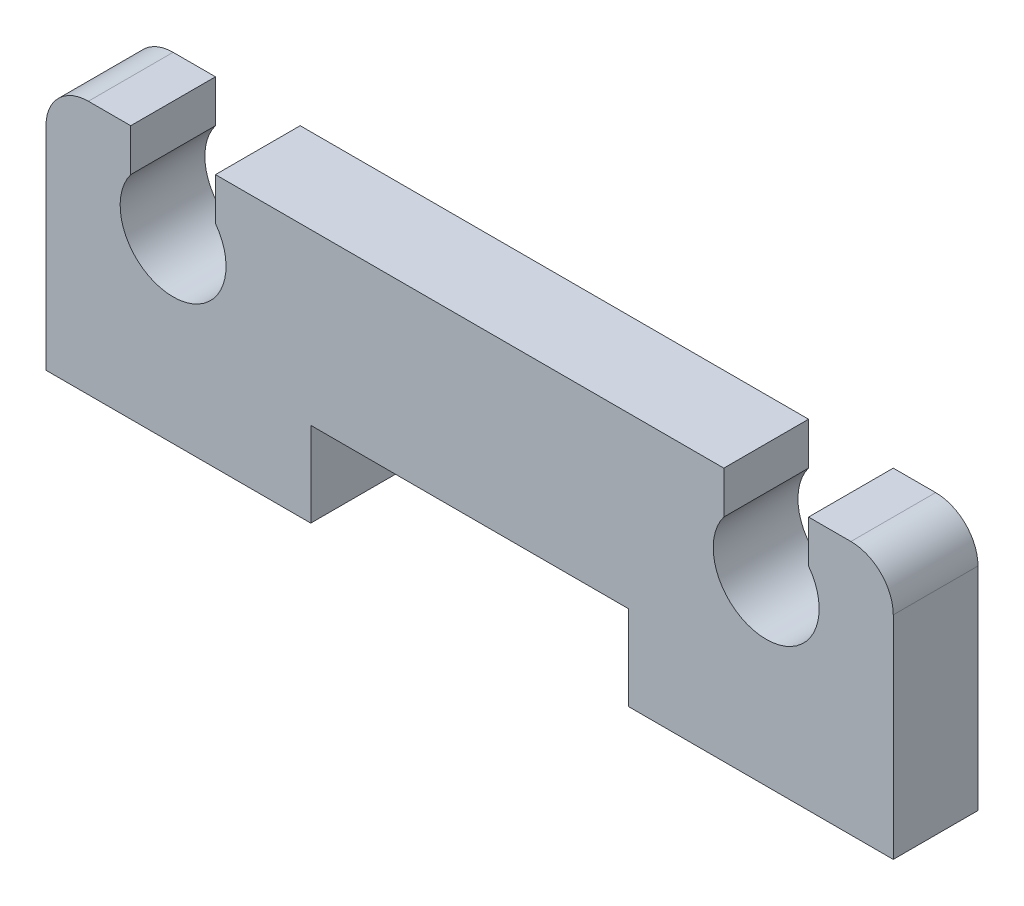
ISO-10303-21;
HEADER;
FILE_DESCRIPTION(('STEP AP214'),'2;1');
FILE_NAME('part.step','',(''),(''),'','','');
FILE_SCHEMA(('AUTOMOTIVE_DESIGN { 1 0 10303 214 1 1 1 1 }'));
ENDSEC;
DATA;
#1=APPLICATION_CONTEXT('core data for automotive mechanical design processes');
#2=APPLICATION_PROTOCOL_DEFINITION('international standard','automotive_design',2000,#1);
#3=PRODUCT_CONTEXT('',#1,'mechanical');
#4=PRODUCT('Part','Part','',(#3));
#5=PRODUCT_RELATED_PRODUCT_CATEGORY('part','',(#4));
#6=PRODUCT_DEFINITION_FORMATION('','',#4);
#7=PRODUCT_DEFINITION_CONTEXT('part definition',#1,'design');
#8=PRODUCT_DEFINITION('design','',#6,#7);
#9=PRODUCT_DEFINITION_SHAPE('','',#8);
#10=(LENGTH_UNIT() NAMED_UNIT(*) SI_UNIT(.MILLI.,.METRE.));
#11=(NAMED_UNIT(*) PLANE_ANGLE_UNIT() SI_UNIT($,.RADIAN.));
#12=(NAMED_UNIT(*) SI_UNIT($,.STERADIAN.) SOLID_ANGLE_UNIT());
#13=UNCERTAINTY_MEASURE_WITH_UNIT(LENGTH_MEASURE(1.E-05),#10,'distance_accuracy_value','');
#14=(GEOMETRIC_REPRESENTATION_CONTEXT(3) GLOBAL_UNCERTAINTY_ASSIGNED_CONTEXT((#13)) GLOBAL_UNIT_ASSIGNED_CONTEXT((#10,
#11,#12)) REPRESENTATION_CONTEXT('',''));
#15=CARTESIAN_POINT('',(0.,0.,0.));
#16=DIRECTION('',(0.,0.,1.));
#17=DIRECTION('',(1.,0.,0.));
#18=AXIS2_PLACEMENT_3D('',#15,#16,#17);
#19=CARTESIAN_POINT('',(0.99999999999989,4.99999999999962,2.));
#20=DIRECTION('',(0.,0.,-1.));
#21=DIRECTION('',(-1.,0.,0.));
#22=AXIS2_PLACEMENT_3D('',#19,#20,#21);
#23=CYLINDRICAL_SURFACE('',#22,0.999999999999896);
#24=CARTESIAN_POINT('',(0.99999999999989,4.99999999999962,0.));
#25=DIRECTION('',(0.,0.,1.));
#26=DIRECTION('',(1.,0.,0.));
#27=AXIS2_PLACEMENT_3D('',#24,#25,#26);
#28=CIRCLE('',#27,0.999999999999896);
#29=CARTESIAN_POINT('',(0.99999999999989,5.99999999999953,0.));
#30=VERTEX_POINT('',#29);
#31=CARTESIAN_POINT('',(0.,4.99999999999963,0.));
#32=VERTEX_POINT('',#31);
#33=EDGE_CURVE('E189',#30,#32,#28,.T.);
#34=ORIENTED_EDGE('',*,*,#33,.T.);
#35=DIRECTION('',(0.,0.,-1.));
#36=VECTOR('',#35,1.);
#37=CARTESIAN_POINT('',(0.,4.99999999999963,2.));
#38=LINE('',#37,#36);
#39=CARTESIAN_POINT('',(0.,4.99999999999963,2.));
#40=VERTEX_POINT('',#39);
#41=EDGE_CURVE('E11',#40,#32,#38,.T.);
#42=ORIENTED_EDGE('',*,*,#41,.F.);
#43=CARTESIAN_POINT('',(0.99999999999989,4.99999999999962,2.));
#44=DIRECTION('',(0.,0.,1.));
#45=DIRECTION('',(1.,0.,0.));
#46=AXIS2_PLACEMENT_3D('',#43,#44,#45);
#47=CIRCLE('',#46,0.999999999999896);
#48=CARTESIAN_POINT('',(0.99999999999989,5.99999999999953,2.));
#49=VERTEX_POINT('',#48);
#50=EDGE_CURVE('E223',#49,#40,#47,.T.);
#51=ORIENTED_EDGE('',*,*,#50,.F.);
#52=DIRECTION('',(0.,0.,-1.));
#53=VECTOR('',#52,1.);
#54=CARTESIAN_POINT('',(0.99999999999989,5.99999999999953,2.));
#55=LINE('',#54,#53);
#56=EDGE_CURVE('E185',#49,#30,#55,.T.);
#57=ORIENTED_EDGE('',*,*,#56,.T.);
#58=EDGE_LOOP('',(#34,#42,#51,#57));
#59=FACE_BOUND('',#58,.T.);
#60=ADVANCED_FACE('F33',(#59),#23,.T.);
#61=CARTESIAN_POINT('',(0.,0.,2.));
#62=DIRECTION('',(1.,0.,0.));
#63=DIRECTION('',(0.,0.,-1.));
#64=AXIS2_PLACEMENT_3D('',#61,#62,#63);
#65=PLANE('',#64);
#66=DIRECTION('',(0.,-1.,0.));
#67=VECTOR('',#66,1.);
#68=CARTESIAN_POINT('',(0.,0.,0.));
#69=LINE('',#68,#67);
#70=CARTESIAN_POINT('',(0.,0.,0.));
#71=VERTEX_POINT('',#70);
#72=EDGE_CURVE('E192',#32,#71,#69,.T.);
#73=ORIENTED_EDGE('',*,*,#72,.T.);
#74=DIRECTION('',(0.,0.,-1.));
#75=VECTOR('',#74,1.);
#76=CARTESIAN_POINT('',(0.,0.,2.));
#77=LINE('',#76,#75);
#78=CARTESIAN_POINT('',(0.,0.,2.));
#79=VERTEX_POINT('',#78);
#80=EDGE_CURVE('E41',#79,#71,#77,.T.);
#81=ORIENTED_EDGE('',*,*,#80,.F.);
#82=DIRECTION('',(0.,-1.,0.));
#83=VECTOR('',#82,1.);
#84=CARTESIAN_POINT('',(0.,0.,2.));
#85=LINE('',#84,#83);
#86=EDGE_CURVE('E122',#40,#79,#85,.T.);
#87=ORIENTED_EDGE('',*,*,#86,.F.);
#88=ORIENTED_EDGE('',*,*,#41,.T.);
#89=EDGE_LOOP('',(#73,#81,#87,#88));
#90=FACE_BOUND('',#89,.T.);
#91=ADVANCED_FACE('F331',(#90),#65,.F.);
#92=CARTESIAN_POINT('',(0.,0.,2.));
#93=DIRECTION('',(0.,1.,0.));
#94=DIRECTION('',(0.,0.,1.));
#95=AXIS2_PLACEMENT_3D('',#92,#93,#94);
#96=PLANE('',#95);
#97=DIRECTION('',(1.,0.,0.));
#98=VECTOR('',#97,1.);
#99=CARTESIAN_POINT('',(0.,0.,0.));
#100=LINE('',#99,#98);
#101=CARTESIAN_POINT('',(6.25000000000026,0.,0.));
#102=VERTEX_POINT('',#101);
#103=EDGE_CURVE('E194',#71,#102,#100,.T.);
#104=ORIENTED_EDGE('',*,*,#103,.T.);
#105=DIRECTION('',(0.,0.,-1.));
#106=VECTOR('',#105,1.);
#107=CARTESIAN_POINT('',(6.25000000000026,0.,2.));
#108=LINE('',#107,#106);
#109=CARTESIAN_POINT('',(6.25000000000026,0.,2.));
#110=VERTEX_POINT('',#109);
#111=EDGE_CURVE('E260',#110,#102,#108,.T.);
#112=ORIENTED_EDGE('',*,*,#111,.F.);
#113=DIRECTION('',(1.,0.,0.));
#114=VECTOR('',#113,1.);
#115=CARTESIAN_POINT('',(0.,0.,2.));
#116=LINE('',#115,#114);
#117=EDGE_CURVE('E268',#79,#110,#116,.T.);
#118=ORIENTED_EDGE('',*,*,#117,.F.);
#119=ORIENTED_EDGE('',*,*,#80,.T.);
#120=EDGE_LOOP('',(#104,#112,#118,#119));
#121=FACE_BOUND('',#120,.T.);
#122=ADVANCED_FACE('F266',(#121),#96,.F.);
#123=CARTESIAN_POINT('',(6.25000000000026,2.00000000000022,2.));
#124=DIRECTION('',(-1.,0.,0.));
#125=DIRECTION('',(0.,0.,1.));
#126=AXIS2_PLACEMENT_3D('',#123,#124,#125);
#127=PLANE('',#126);
#128=DIRECTION('',(0.,1.,0.));
#129=VECTOR('',#128,1.);
#130=CARTESIAN_POINT('',(6.25000000000026,2.00000000000022,0.));
#131=LINE('',#130,#129);
#132=CARTESIAN_POINT('',(6.25000000000026,2.00000000000022,0.));
#133=VERTEX_POINT('',#132);
#134=EDGE_CURVE('E196',#102,#133,#131,.T.);
#135=ORIENTED_EDGE('',*,*,#134,.T.);
#136=DIRECTION('',(0.,0.,-1.));
#137=VECTOR('',#136,1.);
#138=CARTESIAN_POINT('',(6.25000000000026,2.00000000000022,2.));
#139=LINE('',#138,#137);
#140=CARTESIAN_POINT('',(6.25000000000026,2.00000000000022,2.));
#141=VERTEX_POINT('',#140);
#142=EDGE_CURVE('E257',#141,#133,#139,.T.);
#143=ORIENTED_EDGE('',*,*,#142,.F.);
#144=DIRECTION('',(0.,1.,0.));
#145=VECTOR('',#144,1.);
#146=CARTESIAN_POINT('',(6.25000000000026,2.00000000000022,2.));
#147=LINE('',#146,#145);
#148=EDGE_CURVE('E286',#110,#141,#147,.T.);
#149=ORIENTED_EDGE('',*,*,#148,.F.);
#150=ORIENTED_EDGE('',*,*,#111,.T.);
#151=EDGE_LOOP('',(#135,#143,#149,#150));
#152=FACE_BOUND('',#151,.T.);
#153=ADVANCED_FACE('F277',(#152),#127,.F.);
#154=CARTESIAN_POINT('',(6.25000000000026,2.00000000000022,2.));
#155=DIRECTION('',(0.,1.,0.));
#156=DIRECTION('',(0.,0.,1.));
#157=AXIS2_PLACEMENT_3D('',#154,#155,#156);
#158=PLANE('',#157);
#159=DIRECTION('',(1.,0.,0.));
#160=VECTOR('',#159,1.);
#161=CARTESIAN_POINT('',(6.25000000000026,2.00000000000022,0.));
#162=LINE('',#161,#160);
#163=CARTESIAN_POINT('',(13.7500000000023,2.00000000000022,0.));
#164=VERTEX_POINT('',#163);
#165=EDGE_CURVE('E198',#133,#164,#162,.T.);
#166=ORIENTED_EDGE('',*,*,#165,.T.);
#167=DIRECTION('',(0.,0.,-1.));
#168=VECTOR('',#167,1.);
#169=CARTESIAN_POINT('',(13.7500000000023,2.00000000000022,2.));
#170=LINE('',#169,#168);
#171=CARTESIAN_POINT('',(13.7500000000023,2.00000000000022,2.));
#172=VERTEX_POINT('',#171);
#173=EDGE_CURVE('E254',#172,#164,#170,.T.);
#174=ORIENTED_EDGE('',*,*,#173,.F.);
#175=DIRECTION('',(1.,0.,0.));
#176=VECTOR('',#175,1.);
#177=CARTESIAN_POINT('',(6.25000000000026,2.00000000000022,2.));
#178=LINE('',#177,#176);
#179=EDGE_CURVE('E283',#141,#172,#178,.T.);
#180=ORIENTED_EDGE('',*,*,#179,.F.);
#181=ORIENTED_EDGE('',*,*,#142,.T.);
#182=EDGE_LOOP('',(#166,#174,#180,#181));
#183=FACE_BOUND('',#182,.T.);
#184=ADVANCED_FACE('F281',(#183),#158,.F.);
#185=CARTESIAN_POINT('',(13.7500000000023,2.00000000000022,2.));
#186=DIRECTION('',(1.,0.,0.));
#187=DIRECTION('',(0.,0.,-1.));
#188=AXIS2_PLACEMENT_3D('',#185,#186,#187);
#189=PLANE('',#188);
#190=DIRECTION('',(0.,-1.,0.));
#191=VECTOR('',#190,1.);
#192=CARTESIAN_POINT('',(13.7500000000023,2.00000000000022,0.));
#193=LINE('',#192,#191);
#194=CARTESIAN_POINT('',(13.7500000000023,0.,0.));
#195=VERTEX_POINT('',#194);
#196=EDGE_CURVE('E200',#164,#195,#193,.T.);
#197=ORIENTED_EDGE('',*,*,#196,.T.);
#198=DIRECTION('',(0.,0.,-1.));
#199=VECTOR('',#198,1.);
#200=CARTESIAN_POINT('',(13.7500000000023,0.,2.));
#201=LINE('',#200,#199);
#202=CARTESIAN_POINT('',(13.7500000000023,0.,2.));
#203=VERTEX_POINT('',#202);
#204=EDGE_CURVE('E251',#203,#195,#201,.T.);
#205=ORIENTED_EDGE('',*,*,#204,.F.);
#206=DIRECTION('',(0.,-1.,0.));
#207=VECTOR('',#206,1.);
#208=CARTESIAN_POINT('',(13.7500000000023,2.00000000000022,2.));
#209=LINE('',#208,#207);
#210=EDGE_CURVE('E285',#172,#203,#209,.T.);
#211=ORIENTED_EDGE('',*,*,#210,.F.);
#212=ORIENTED_EDGE('',*,*,#173,.T.);
#213=EDGE_LOOP('',(#197,#205,#211,#212));
#214=FACE_BOUND('',#213,.T.);
#215=ADVANCED_FACE('F344',(#214),#189,.F.);
#216=CARTESIAN_POINT('',(13.7500000000023,0.,2.));
#217=DIRECTION('',(0.,1.,0.));
#218=DIRECTION('',(-1.,0.,0.));
#219=AXIS2_PLACEMENT_3D('',#216,#217,#218);
#220=PLANE('',#219);
#221=DIRECTION('',(1.,0.,0.));
#222=VECTOR('',#221,1.);
#223=CARTESIAN_POINT('',(13.7500000000023,0.,0.));
#224=LINE('',#223,#222);
#225=CARTESIAN_POINT('',(20.0000000000026,0.,0.));
#226=VERTEX_POINT('',#225);
#227=EDGE_CURVE('E202',#195,#226,#224,.T.);
#228=ORIENTED_EDGE('',*,*,#227,.T.);
#229=DIRECTION('',(0.,0.,-1.));
#230=VECTOR('',#229,1.);
#231=CARTESIAN_POINT('',(20.0000000000026,0.,2.));
#232=LINE('',#231,#230);
#233=CARTESIAN_POINT('',(20.0000000000026,0.,2.));
#234=VERTEX_POINT('',#233);
#235=EDGE_CURVE('E248',#234,#226,#232,.T.);
#236=ORIENTED_EDGE('',*,*,#235,.F.);
#237=DIRECTION('',(1.,0.,0.));
#238=VECTOR('',#237,1.);
#239=CARTESIAN_POINT('',(13.7500000000023,0.,2.));
#240=LINE('',#239,#238);
#241=EDGE_CURVE('E288',#203,#234,#240,.T.);
#242=ORIENTED_EDGE('',*,*,#241,.F.);
#243=ORIENTED_EDGE('',*,*,#204,.T.);
#244=EDGE_LOOP('',(#228,#236,#242,#243));
#245=FACE_BOUND('',#244,.T.);
#246=ADVANCED_FACE('F347',(#245),#220,.F.);
#247=CARTESIAN_POINT('',(20.0000000000026,4.99999999999986,2.));
#248=DIRECTION('',(-1.,0.,0.));
#249=DIRECTION('',(0.,0.,1.));
#250=AXIS2_PLACEMENT_3D('',#247,#248,#249);
#251=PLANE('',#250);
#252=DIRECTION('',(0.,1.,0.));
#253=VECTOR('',#252,1.);
#254=CARTESIAN_POINT('',(20.0000000000026,4.99999999999986,0.));
#255=LINE('',#254,#253);
#256=CARTESIAN_POINT('',(20.0000000000026,4.99999999999986,0.));
#257=VERTEX_POINT('',#256);
#258=EDGE_CURVE('E204',#226,#257,#255,.T.);
#259=ORIENTED_EDGE('',*,*,#258,.T.);
#260=DIRECTION('',(0.,0.,-1.));
#261=VECTOR('',#260,1.);
#262=CARTESIAN_POINT('',(20.0000000000026,4.99999999999986,2.));
#263=LINE('',#262,#261);
#264=CARTESIAN_POINT('',(20.0000000000026,4.99999999999986,2.));
#265=VERTEX_POINT('',#264);
#266=EDGE_CURVE('E245',#265,#257,#263,.T.);
#267=ORIENTED_EDGE('',*,*,#266,.F.);
#268=DIRECTION('',(0.,1.,0.));
#269=VECTOR('',#268,1.);
#270=CARTESIAN_POINT('',(20.0000000000026,4.99999999999986,2.));
#271=LINE('',#270,#269);
#272=EDGE_CURVE('E294',#234,#265,#271,.T.);
#273=ORIENTED_EDGE('',*,*,#272,.F.);
#274=ORIENTED_EDGE('',*,*,#235,.T.);
#275=EDGE_LOOP('',(#259,#267,#273,#274));
#276=FACE_BOUND('',#275,.T.);
#277=ADVANCED_FACE('F351',(#276),#251,.F.);
#278=CARTESIAN_POINT('',(19.0000000000027,4.99999999999986,2.));
#279=DIRECTION('',(0.,0.,-1.));
#280=DIRECTION('',(-1.,0.,0.));
#281=AXIS2_PLACEMENT_3D('',#278,#279,#280);
#282=CYLINDRICAL_SURFACE('',#281,0.99999999999989);
#283=CARTESIAN_POINT('',(19.0000000000027,4.99999999999986,0.));
#284=DIRECTION('',(0.,0.,1.));
#285=DIRECTION('',(1.,0.,0.));
#286=AXIS2_PLACEMENT_3D('',#283,#284,#285);
#287=CIRCLE('',#286,0.99999999999989);
#288=CARTESIAN_POINT('',(19.0000000000027,5.99999999999975,0.));
#289=VERTEX_POINT('',#288);
#290=EDGE_CURVE('E206',#257,#289,#287,.T.);
#291=ORIENTED_EDGE('',*,*,#290,.T.);
#292=DIRECTION('',(0.,0.,-1.));
#293=VECTOR('',#292,1.);
#294=CARTESIAN_POINT('',(19.0000000000027,5.99999999999975,2.));
#295=LINE('',#294,#293);
#296=CARTESIAN_POINT('',(19.0000000000027,5.99999999999975,2.));
#297=VERTEX_POINT('',#296);
#298=EDGE_CURVE('E242',#297,#289,#295,.T.);
#299=ORIENTED_EDGE('',*,*,#298,.F.);
#300=CARTESIAN_POINT('',(19.0000000000027,4.99999999999986,2.));
#301=DIRECTION('',(0.,0.,1.));
#302=DIRECTION('',(1.,0.,0.));
#303=AXIS2_PLACEMENT_3D('',#300,#301,#302);
#304=CIRCLE('',#303,0.99999999999989);
#305=EDGE_CURVE('E296',#265,#297,#304,.T.);
#306=ORIENTED_EDGE('',*,*,#305,.F.);
#307=ORIENTED_EDGE('',*,*,#266,.T.);
#308=EDGE_LOOP('',(#291,#299,#306,#307));
#309=FACE_BOUND('',#308,.T.);
#310=ADVANCED_FACE('F355',(#309),#282,.T.);
#311=CARTESIAN_POINT('',(18.0000000000028,5.99999999999975,2.));
#312=DIRECTION('',(0.,-1.,0.));
#313=DIRECTION('',(0.,0.,-1.));
#314=AXIS2_PLACEMENT_3D('',#311,#312,#313);
#315=PLANE('',#314);
#316=DIRECTION('',(-1.,0.,0.));
#317=VECTOR('',#316,1.);
#318=CARTESIAN_POINT('',(18.0000000000028,5.99999999999975,0.));
#319=LINE('',#318,#317);
#320=CARTESIAN_POINT('',(18.0000000000028,5.99999999999975,0.));
#321=VERTEX_POINT('',#320);
#322=EDGE_CURVE('E208',#289,#321,#319,.T.);
#323=ORIENTED_EDGE('',*,*,#322,.T.);
#324=DIRECTION('',(0.,0.,-1.));
#325=VECTOR('',#324,1.);
#326=CARTESIAN_POINT('',(18.0000000000028,5.99999999999975,2.));
#327=LINE('',#326,#325);
#328=CARTESIAN_POINT('',(18.0000000000028,5.99999999999975,2.));
#329=VERTEX_POINT('',#328);
#330=EDGE_CURVE('E239',#329,#321,#327,.T.);
#331=ORIENTED_EDGE('',*,*,#330,.F.);
#332=DIRECTION('',(-1.,0.,0.));
#333=VECTOR('',#332,1.);
#334=CARTESIAN_POINT('',(18.0000000000028,5.99999999999975,2.));
#335=LINE('',#334,#333);
#336=EDGE_CURVE('E298',#297,#329,#335,.T.);
#337=ORIENTED_EDGE('',*,*,#336,.F.);
#338=ORIENTED_EDGE('',*,*,#298,.T.);
#339=EDGE_LOOP('',(#323,#331,#337,#338));
#340=FACE_BOUND('',#339,.T.);
#341=ADVANCED_FACE('F359',(#340),#315,.F.);
#342=CARTESIAN_POINT('',(18.0000000000028,5.99999999999975,2.));
#343=DIRECTION('',(1.,0.,0.));
#344=DIRECTION('',(0.,0.,-1.));
#345=AXIS2_PLACEMENT_3D('',#342,#343,#344);
#346=PLANE('',#345);
#347=DIRECTION('',(0.,-1.,0.));
#348=VECTOR('',#347,1.);
#349=CARTESIAN_POINT('',(18.0000000000028,5.99999999999975,0.));
#350=LINE('',#349,#348);
#351=CARTESIAN_POINT('',(18.0000000000029,4.9999999999999,0.));
#352=VERTEX_POINT('',#351);
#353=EDGE_CURVE('E210',#321,#352,#350,.T.);
#354=ORIENTED_EDGE('',*,*,#353,.T.);
#355=DIRECTION('',(0.,0.,-1.));
#356=VECTOR('',#355,1.);
#357=CARTESIAN_POINT('',(18.0000000000029,4.9999999999999,2.));
#358=LINE('',#357,#356);
#359=CARTESIAN_POINT('',(18.0000000000029,4.9999999999999,2.));
#360=VERTEX_POINT('',#359);
#361=EDGE_CURVE('E236',#360,#352,#358,.T.);
#362=ORIENTED_EDGE('',*,*,#361,.F.);
#363=DIRECTION('',(0.,-1.,0.));
#364=VECTOR('',#363,1.);
#365=CARTESIAN_POINT('',(18.0000000000028,5.99999999999975,2.));
#366=LINE('',#365,#364);
#367=EDGE_CURVE('E300',#329,#360,#366,.T.);
#368=ORIENTED_EDGE('',*,*,#367,.F.);
#369=ORIENTED_EDGE('',*,*,#330,.T.);
#370=EDGE_LOOP('',(#354,#362,#368,#369));
#371=FACE_BOUND('',#370,.T.);
#372=ADVANCED_FACE('F363',(#371),#346,.F.);
#373=CARTESIAN_POINT('',(17.000000000002,4.25000000000111,2.));
#374=DIRECTION('',(0.,0.,-1.));
#375=DIRECTION('',(-1.,0.,0.));
#376=AXIS2_PLACEMENT_3D('',#373,#374,#375);
#377=CYLINDRICAL_SURFACE('',#376,1.24999999999995);
#378=CARTESIAN_POINT('',(17.000000000002,4.25000000000111,0.));
#379=DIRECTION('',(0.,0.,-1.));
#380=DIRECTION('',(1.,0.,0.));
#381=AXIS2_PLACEMENT_3D('',#378,#379,#380);
#382=CIRCLE('',#381,1.24999999999995);
#383=CARTESIAN_POINT('',(16.0000000000009,4.99999999999964,0.));
#384=VERTEX_POINT('',#383);
#385=EDGE_CURVE('E212',#352,#384,#382,.T.);
#386=ORIENTED_EDGE('',*,*,#385,.T.);
#387=DIRECTION('',(0.,0.,-1.));
#388=VECTOR('',#387,1.);
#389=CARTESIAN_POINT('',(16.0000000000009,4.99999999999964,2.));
#390=LINE('',#389,#388);
#391=CARTESIAN_POINT('',(16.0000000000009,4.99999999999964,2.));
#392=VERTEX_POINT('',#391);
#393=EDGE_CURVE('E233',#392,#384,#390,.T.);
#394=ORIENTED_EDGE('',*,*,#393,.F.);
#395=CARTESIAN_POINT('',(17.000000000002,4.25000000000111,2.));
#396=DIRECTION('',(0.,0.,-1.));
#397=DIRECTION('',(1.,0.,0.));
#398=AXIS2_PLACEMENT_3D('',#395,#396,#397);
#399=CIRCLE('',#398,1.24999999999995);
#400=EDGE_CURVE('E302',#360,#392,#399,.T.);
#401=ORIENTED_EDGE('',*,*,#400,.F.);
#402=ORIENTED_EDGE('',*,*,#361,.T.);
#403=EDGE_LOOP('',(#386,#394,#401,#402));
#404=FACE_BOUND('',#403,.T.);
#405=ADVANCED_FACE('F367',(#404),#377,.F.);
#406=CARTESIAN_POINT('',(16.0000000000009,5.99999999999953,2.));
#407=DIRECTION('',(-1.,0.,0.));
#408=DIRECTION('',(0.,0.,1.));
#409=AXIS2_PLACEMENT_3D('',#406,#407,#408);
#410=PLANE('',#409);
#411=DIRECTION('',(0.,1.,0.));
#412=VECTOR('',#411,1.);
#413=CARTESIAN_POINT('',(16.0000000000009,5.99999999999953,0.));
#414=LINE('',#413,#412);
#415=CARTESIAN_POINT('',(16.0000000000009,5.99999999999953,0.));
#416=VERTEX_POINT('',#415);
#417=EDGE_CURVE('E214',#384,#416,#414,.T.);
#418=ORIENTED_EDGE('',*,*,#417,.T.);
#419=DIRECTION('',(0.,0.,-1.));
#420=VECTOR('',#419,1.);
#421=CARTESIAN_POINT('',(16.0000000000009,5.99999999999953,2.));
#422=LINE('',#421,#420);
#423=CARTESIAN_POINT('',(16.0000000000009,5.99999999999953,2.));
#424=VERTEX_POINT('',#423);
#425=EDGE_CURVE('E230',#424,#416,#422,.T.);
#426=ORIENTED_EDGE('',*,*,#425,.F.);
#427=DIRECTION('',(0.,1.,0.));
#428=VECTOR('',#427,1.);
#429=CARTESIAN_POINT('',(16.0000000000009,5.99999999999953,2.));
#430=LINE('',#429,#428);
#431=EDGE_CURVE('E304',#392,#424,#430,.T.);
#432=ORIENTED_EDGE('',*,*,#431,.F.);
#433=ORIENTED_EDGE('',*,*,#393,.T.);
#434=EDGE_LOOP('',(#418,#426,#432,#433));
#435=FACE_BOUND('',#434,.T.);
#436=ADVANCED_FACE('F371',(#435),#410,.F.);
#437=CARTESIAN_POINT('',(4.00000000000182,5.99999999999952,2.));
#438=DIRECTION('',(0.,-1.,0.));
#439=DIRECTION('',(1.,0.,0.));
#440=AXIS2_PLACEMENT_3D('',#437,#438,#439);
#441=PLANE('',#440);
#442=DIRECTION('',(-1.,0.,0.));
#443=VECTOR('',#442,1.);
#444=CARTESIAN_POINT('',(4.00000000000182,5.99999999999952,0.));
#445=LINE('',#444,#443);
#446=CARTESIAN_POINT('',(4.00000000000182,5.99999999999952,0.));
#447=VERTEX_POINT('',#446);
#448=EDGE_CURVE('E216',#416,#447,#445,.T.);
#449=ORIENTED_EDGE('',*,*,#448,.T.);
#450=DIRECTION('',(0.,0.,-1.));
#451=VECTOR('',#450,1.);
#452=CARTESIAN_POINT('',(4.00000000000182,5.99999999999952,2.));
#453=LINE('',#452,#451);
#454=CARTESIAN_POINT('',(4.00000000000182,5.99999999999952,2.));
#455=VERTEX_POINT('',#454);
#456=EDGE_CURVE('E227',#455,#447,#453,.T.);
#457=ORIENTED_EDGE('',*,*,#456,.F.);
#458=DIRECTION('',(-1.,0.,0.));
#459=VECTOR('',#458,1.);
#460=CARTESIAN_POINT('',(4.00000000000182,5.99999999999952,2.));
#461=LINE('',#460,#459);
#462=EDGE_CURVE('E306',#424,#455,#461,.T.);
#463=ORIENTED_EDGE('',*,*,#462,.F.);
#464=ORIENTED_EDGE('',*,*,#425,.T.);
#465=EDGE_LOOP('',(#449,#457,#463,#464));
#466=FACE_BOUND('',#465,.T.);
#467=ADVANCED_FACE('F312',(#466),#441,.F.);
#468=CARTESIAN_POINT('',(4.00000000000182,5.99999999999952,2.));
#469=DIRECTION('',(1.,0.,0.));
#470=DIRECTION('',(0.,0.,-1.));
#471=AXIS2_PLACEMENT_3D('',#468,#469,#470);
#472=PLANE('',#471);
#473=DIRECTION('',(0.,-1.,0.));
#474=VECTOR('',#473,1.);
#475=CARTESIAN_POINT('',(4.00000000000182,5.99999999999952,0.));
#476=LINE('',#475,#474);
#477=CARTESIAN_POINT('',(4.00000000000179,4.9999999999996,0.));
#478=VERTEX_POINT('',#477);
#479=EDGE_CURVE('E218',#447,#478,#476,.T.);
#480=ORIENTED_EDGE('',*,*,#479,.T.);
#481=DIRECTION('',(0.,0.,-1.));
#482=VECTOR('',#481,1.);
#483=CARTESIAN_POINT('',(4.00000000000179,4.9999999999996,2.));
#484=LINE('',#483,#482);
#485=CARTESIAN_POINT('',(4.00000000000179,4.9999999999996,2.));
#486=VERTEX_POINT('',#485);
#487=EDGE_CURVE('E180',#486,#478,#484,.T.);
#488=ORIENTED_EDGE('',*,*,#487,.F.);
#489=DIRECTION('',(0.,-1.,0.));
#490=VECTOR('',#489,1.);
#491=CARTESIAN_POINT('',(4.00000000000182,5.99999999999952,2.));
#492=LINE('',#491,#490);
#493=EDGE_CURVE('E171',#455,#486,#492,.T.);
#494=ORIENTED_EDGE('',*,*,#493,.F.);
#495=ORIENTED_EDGE('',*,*,#456,.T.);
#496=EDGE_LOOP('',(#480,#488,#494,#495));
#497=FACE_BOUND('',#496,.T.);
#498=ADVANCED_FACE('F316',(#497),#472,.F.);
#499=CARTESIAN_POINT('',(3.00000000000075,4.25000000000111,2.));
#500=DIRECTION('',(0.,0.,-1.));
#501=DIRECTION('',(-1.,0.,0.));
#502=AXIS2_PLACEMENT_3D('',#499,#500,#501);
#503=CYLINDRICAL_SURFACE('',#502,1.24999999999992);
#504=CARTESIAN_POINT('',(3.00000000000075,4.25000000000111,0.));
#505=DIRECTION('',(0.,0.,-1.));
#506=DIRECTION('',(1.,0.,0.));
#507=AXIS2_PLACEMENT_3D('',#504,#505,#506);
#508=CIRCLE('',#507,1.24999999999992);
#509=CARTESIAN_POINT('',(1.99999999999978,4.99999999999962,0.));
#510=VERTEX_POINT('',#509);
#511=EDGE_CURVE('E179',#478,#510,#508,.T.);
#512=ORIENTED_EDGE('',*,*,#511,.T.);
#513=DIRECTION('',(0.,0.,-1.));
#514=VECTOR('',#513,1.);
#515=CARTESIAN_POINT('',(1.99999999999978,4.99999999999962,2.));
#516=LINE('',#515,#514);
#517=CARTESIAN_POINT('',(1.99999999999978,4.99999999999962,2.));
#518=VERTEX_POINT('',#517);
#519=EDGE_CURVE('E176',#518,#510,#516,.T.);
#520=ORIENTED_EDGE('',*,*,#519,.F.);
#521=CARTESIAN_POINT('',(3.00000000000075,4.25000000000111,2.));
#522=DIRECTION('',(0.,0.,-1.));
#523=DIRECTION('',(1.,0.,0.));
#524=AXIS2_PLACEMENT_3D('',#521,#522,#523);
#525=CIRCLE('',#524,1.24999999999992);
#526=EDGE_CURVE('E165',#486,#518,#525,.T.);
#527=ORIENTED_EDGE('',*,*,#526,.F.);
#528=ORIENTED_EDGE('',*,*,#487,.T.);
#529=EDGE_LOOP('',(#512,#520,#527,#528));
#530=FACE_BOUND('',#529,.T.);
#531=ADVANCED_FACE('F177',(#530),#503,.F.);
#532=CARTESIAN_POINT('',(1.99999999999978,5.99999999999951,2.));
#533=DIRECTION('',(-1.,0.,0.));
#534=DIRECTION('',(0.,0.,1.));
#535=AXIS2_PLACEMENT_3D('',#532,#533,#534);
#536=PLANE('',#535);
#537=DIRECTION('',(0.,1.,0.));
#538=VECTOR('',#537,1.);
#539=CARTESIAN_POINT('',(1.99999999999978,5.99999999999951,0.));
#540=LINE('',#539,#538);
#541=CARTESIAN_POINT('',(1.99999999999978,5.99999999999951,0.));
#542=VERTEX_POINT('',#541);
#543=EDGE_CURVE('E108',#510,#542,#540,.T.);
#544=ORIENTED_EDGE('',*,*,#543,.T.);
#545=DIRECTION('',(0.,0.,-1.));
#546=VECTOR('',#545,1.);
#547=CARTESIAN_POINT('',(1.99999999999978,5.99999999999951,2.));
#548=LINE('',#547,#546);
#549=CARTESIAN_POINT('',(1.99999999999978,5.99999999999951,2.));
#550=VERTEX_POINT('',#549);
#551=EDGE_CURVE('E181',#550,#542,#548,.T.);
#552=ORIENTED_EDGE('',*,*,#551,.F.);
#553=DIRECTION('',(0.,1.,0.));
#554=VECTOR('',#553,1.);
#555=CARTESIAN_POINT('',(1.99999999999978,5.99999999999951,2.));
#556=LINE('',#555,#554);
#557=EDGE_CURVE('E169',#518,#550,#556,.T.);
#558=ORIENTED_EDGE('',*,*,#557,.F.);
#559=ORIENTED_EDGE('',*,*,#519,.T.);
#560=EDGE_LOOP('',(#544,#552,#558,#559));
#561=FACE_BOUND('',#560,.T.);
#562=ADVANCED_FACE('F183',(#561),#536,.F.);
#563=CARTESIAN_POINT('',(1.99999999999978,5.99999999999951,2.));
#564=DIRECTION('',(0.,-1.,0.));
#565=DIRECTION('',(1.,0.,0.));
#566=AXIS2_PLACEMENT_3D('',#563,#564,#565);
#567=PLANE('',#566);
#568=DIRECTION('',(-1.,0.,0.));
#569=VECTOR('',#568,1.);
#570=CARTESIAN_POINT('',(1.99999999999978,5.99999999999951,0.));
#571=LINE('',#570,#569);
#572=EDGE_CURVE('E114',#542,#30,#571,.T.);
#573=ORIENTED_EDGE('',*,*,#572,.T.);
#574=ORIENTED_EDGE('',*,*,#56,.F.);
#575=DIRECTION('',(-1.,0.,0.));
#576=VECTOR('',#575,1.);
#577=CARTESIAN_POINT('',(1.99999999999978,5.99999999999951,2.));
#578=LINE('',#577,#576);
#579=EDGE_CURVE('E49',#550,#49,#578,.T.);
#580=ORIENTED_EDGE('',*,*,#579,.F.);
#581=ORIENTED_EDGE('',*,*,#551,.T.);
#582=EDGE_LOOP('',(#573,#574,#580,#581));
#583=FACE_BOUND('',#582,.T.);
#584=ADVANCED_FACE('F320',(#583),#567,.F.);
#585=CARTESIAN_POINT('',(0.99999999999989,4.99999999999962,2.));
#586=DIRECTION('',(0.,0.,1.));
#587=DIRECTION('',(1.,0.,0.));
#588=AXIS2_PLACEMENT_3D('',#585,#586,#587);
#589=PLANE('',#588);
#590=ORIENTED_EDGE('',*,*,#50,.T.);
#591=ORIENTED_EDGE('',*,*,#86,.T.);
#592=ORIENTED_EDGE('',*,*,#117,.T.);
#593=ORIENTED_EDGE('',*,*,#148,.T.);
#594=ORIENTED_EDGE('',*,*,#179,.T.);
#595=ORIENTED_EDGE('',*,*,#210,.T.);
#596=ORIENTED_EDGE('',*,*,#241,.T.);
#597=ORIENTED_EDGE('',*,*,#272,.T.);
#598=ORIENTED_EDGE('',*,*,#305,.T.);
#599=ORIENTED_EDGE('',*,*,#336,.T.);
#600=ORIENTED_EDGE('',*,*,#367,.T.);
#601=ORIENTED_EDGE('',*,*,#400,.T.);
#602=ORIENTED_EDGE('',*,*,#431,.T.);
#603=ORIENTED_EDGE('',*,*,#462,.T.);
#604=ORIENTED_EDGE('',*,*,#493,.T.);
#605=ORIENTED_EDGE('',*,*,#526,.T.);
#606=ORIENTED_EDGE('',*,*,#557,.T.);
#607=ORIENTED_EDGE('',*,*,#579,.T.);
#608=EDGE_LOOP('',(#590,#591,#592,#593,#594,#595,#596,#597,#598,#599,#600,#601,#602,#603,#604,
#605,#606,#607));
#609=FACE_BOUND('',#608,.T.);
#610=ADVANCED_FACE('F167',(#609),#589,.T.);
#611=CARTESIAN_POINT('',(0.99999999999989,4.99999999999962,0.));
#612=DIRECTION('',(0.,0.,1.));
#613=DIRECTION('',(1.,0.,0.));
#614=AXIS2_PLACEMENT_3D('',#611,#612,#613);
#615=PLANE('',#614);
#616=ORIENTED_EDGE('',*,*,#33,.F.);
#617=ORIENTED_EDGE('',*,*,#572,.F.);
#618=ORIENTED_EDGE('',*,*,#543,.F.);
#619=ORIENTED_EDGE('',*,*,#511,.F.);
#620=ORIENTED_EDGE('',*,*,#479,.F.);
#621=ORIENTED_EDGE('',*,*,#448,.F.);
#622=ORIENTED_EDGE('',*,*,#417,.F.);
#623=ORIENTED_EDGE('',*,*,#385,.F.);
#624=ORIENTED_EDGE('',*,*,#353,.F.);
#625=ORIENTED_EDGE('',*,*,#322,.F.);
#626=ORIENTED_EDGE('',*,*,#290,.F.);
#627=ORIENTED_EDGE('',*,*,#258,.F.);
#628=ORIENTED_EDGE('',*,*,#227,.F.);
#629=ORIENTED_EDGE('',*,*,#196,.F.);
#630=ORIENTED_EDGE('',*,*,#165,.F.);
#631=ORIENTED_EDGE('',*,*,#134,.F.);
#632=ORIENTED_EDGE('',*,*,#103,.F.);
#633=ORIENTED_EDGE('',*,*,#72,.F.);
#634=EDGE_LOOP('',(#616,#617,#618,#619,#620,#621,#622,#623,#624,#625,#626,#627,#628,#629,#630,
#631,#632,#633));
#635=FACE_BOUND('',#634,.T.);
#636=ADVANCED_FACE('F272',(#635),#615,.F.);
#637=CLOSED_SHELL('',(#60,#91,#122,#153,#184,#215,#246,#277,#310,#341,#372,#405,#436,#467,#498,
#531,#562,#584,#610,#636));
#638=MANIFOLD_SOLID_BREP('B2',#637);
#639=ADVANCED_BREP_SHAPE_REPRESENTATION('',(#18,#638),#14);
#640=SHAPE_DEFINITION_REPRESENTATION(#9,#639);
ENDSEC;
END-ISO-10303-21;
